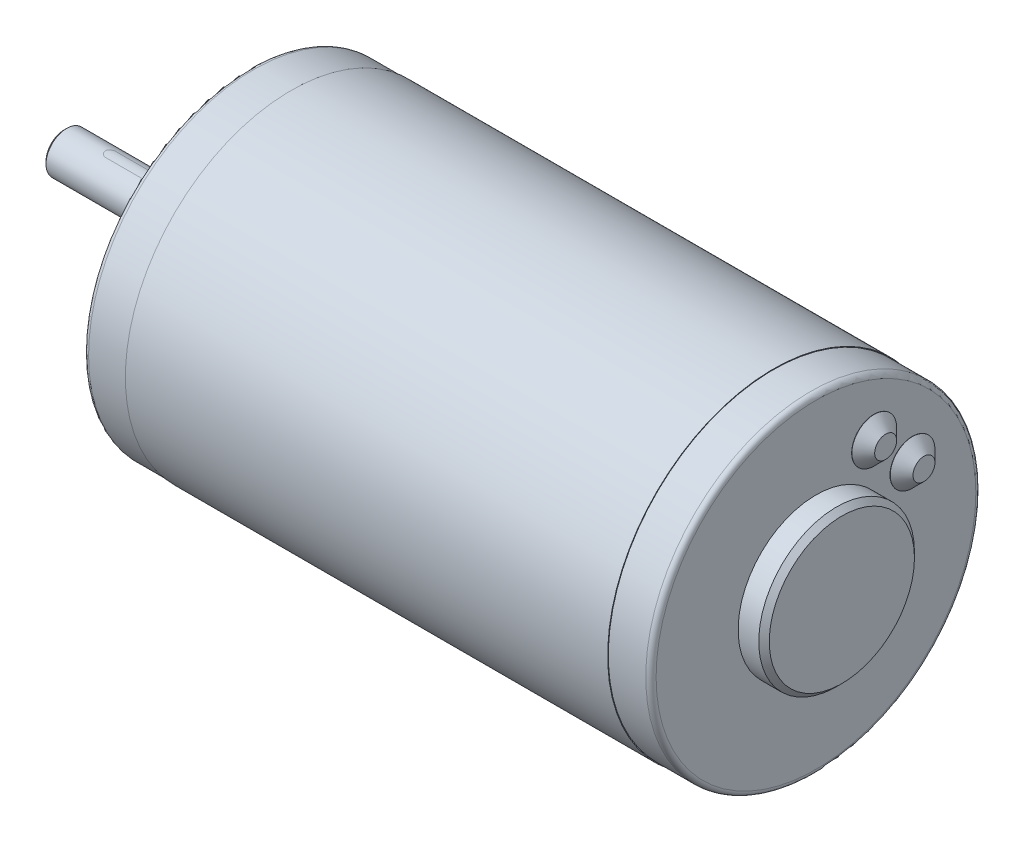
ISO-10303-21;
HEADER;
FILE_DESCRIPTION(('STEP AP214'),'2;1');
FILE_NAME('part.step','',(''),(''),'','','');
FILE_SCHEMA(('AUTOMOTIVE_DESIGN { 1 0 10303 214 1 1 1 1 }'));
ENDSEC;
DATA;
#1=APPLICATION_CONTEXT('core data for automotive mechanical design processes');
#2=APPLICATION_PROTOCOL_DEFINITION('international standard','automotive_design',2000,#1);
#3=PRODUCT_CONTEXT('',#1,'mechanical');
#4=PRODUCT('Part','Part','',(#3));
#5=PRODUCT_RELATED_PRODUCT_CATEGORY('part','',(#4));
#6=PRODUCT_DEFINITION_FORMATION('','',#4);
#7=PRODUCT_DEFINITION_CONTEXT('part definition',#1,'design');
#8=PRODUCT_DEFINITION('design','',#6,#7);
#9=PRODUCT_DEFINITION_SHAPE('','',#8);
#10=(LENGTH_UNIT() NAMED_UNIT(*) SI_UNIT(.MILLI.,.METRE.));
#11=(NAMED_UNIT(*) PLANE_ANGLE_UNIT() SI_UNIT($,.RADIAN.));
#12=(NAMED_UNIT(*) SI_UNIT($,.STERADIAN.) SOLID_ANGLE_UNIT());
#13=UNCERTAINTY_MEASURE_WITH_UNIT(LENGTH_MEASURE(1.E-05),#10,'distance_accuracy_value','');
#14=(GEOMETRIC_REPRESENTATION_CONTEXT(3) GLOBAL_UNCERTAINTY_ASSIGNED_CONTEXT((#13)) GLOBAL_UNIT_ASSIGNED_CONTEXT((#10,
#11,#12)) REPRESENTATION_CONTEXT('',''));
#15=CARTESIAN_POINT('',(0.,0.,0.));
#16=DIRECTION('',(0.,0.,1.));
#17=DIRECTION('',(1.,0.,0.));
#18=AXIS2_PLACEMENT_3D('',#15,#16,#17);
#19=CARTESIAN_POINT('',(-4.,0.,0.));
#20=DIRECTION('',(-1.,0.,0.));
#21=DIRECTION('',(0.,0.,1.));
#22=AXIS2_PLACEMENT_3D('',#19,#20,#21);
#23=PLANE('',#22);
#24=CARTESIAN_POINT('',(-4.,0.,0.));
#25=DIRECTION('',(-1.,0.,0.));
#26=DIRECTION('',(0.,0.,1.));
#27=AXIS2_PLACEMENT_3D('',#24,#25,#26);
#28=CIRCLE('',#27,8.50900000000004);
#29=CARTESIAN_POINT('',(-4.,0.,8.50900000000004));
#30=VERTEX_POINT('',#29);
#31=EDGE_CURVE('P0_E194',#30,#30,#28,.T.);
#32=ORIENTED_EDGE('',*,*,#31,.T.);
#33=EDGE_LOOP('',(#32));
#34=FACE_BOUND('',#33,.T.);
#35=CARTESIAN_POINT('',(-4.,0.,0.));
#36=DIRECTION('',(-1.,0.,0.));
#37=DIRECTION('',(0.,0.,1.));
#38=AXIS2_PLACEMENT_3D('',#35,#36,#37);
#39=CIRCLE('',#38,4.);
#40=CARTESIAN_POINT('',(-4.,0.,4.));
#41=VERTEX_POINT('',#40);
#42=EDGE_CURVE('P0_E120',#41,#41,#39,.T.);
#43=ORIENTED_EDGE('',*,*,#42,.F.);
#44=EDGE_LOOP('',(#43));
#45=FACE_BOUND('',#44,.T.);
#46=ADVANCED_FACE('P0_F37',(#34,#45),#23,.T.);
#47=CARTESIAN_POINT('',(0.,0.,0.));
#48=DIRECTION('',(-1.,0.,0.));
#49=DIRECTION('',(0.,0.,1.));
#50=AXIS2_PLACEMENT_3D('',#47,#48,#49);
#51=PLANE('',#50);
#52=CARTESIAN_POINT('',(0.,0.,0.));
#53=DIRECTION('',(-1.,0.,0.));
#54=DIRECTION('',(0.,0.,1.));
#55=AXIS2_PLACEMENT_3D('',#52,#53,#54);
#56=CIRCLE('',#55,30.877);
#57=CARTESIAN_POINT('',(0.,0.,30.877));
#58=VERTEX_POINT('',#57);
#59=EDGE_CURVE('P0_E45',#58,#58,#56,.T.);
#60=ORIENTED_EDGE('',*,*,#59,.T.);
#61=EDGE_LOOP('',(#60));
#62=FACE_BOUND('',#61,.T.);
#63=CARTESIAN_POINT('',(0.,25.4,0.));
#64=DIRECTION('',(-1.,0.,0.));
#65=DIRECTION('',(0.,0.,1.));
#66=AXIS2_PLACEMENT_3D('',#63,#64,#65);
#67=CIRCLE('',#66,2.01929999999999);
#68=CARTESIAN_POINT('',(0.,25.4,2.01929999999999));
#69=VERTEX_POINT('',#68);
#70=EDGE_CURVE('P0_E94',#69,#69,#67,.T.);
#71=ORIENTED_EDGE('',*,*,#70,.F.);
#72=EDGE_LOOP('',(#71));
#73=FACE_BOUND('',#72,.T.);
#74=CARTESIAN_POINT('',(0.,-25.4,0.));
#75=DIRECTION('',(-1.,0.,0.));
#76=DIRECTION('',(0.,0.,1.));
#77=AXIS2_PLACEMENT_3D('',#74,#75,#76);
#78=CIRCLE('',#77,2.01929999999999);
#79=CARTESIAN_POINT('',(0.,-25.4,2.01929999999999));
#80=VERTEX_POINT('',#79);
#81=EDGE_CURVE('P0_E93',#80,#80,#78,.T.);
#82=ORIENTED_EDGE('',*,*,#81,.F.);
#83=EDGE_LOOP('',(#82));
#84=FACE_BOUND('',#83,.T.);
#85=CARTESIAN_POINT('',(0.,0.,0.));
#86=DIRECTION('',(-1.,0.,0.));
#87=DIRECTION('',(0.,0.,1.));
#88=AXIS2_PLACEMENT_3D('',#85,#86,#87);
#89=CIRCLE('',#88,9.525);
#90=CARTESIAN_POINT('',(0.,0.,9.525));
#91=VERTEX_POINT('',#90);
#92=EDGE_CURVE('P0_E164',#91,#91,#89,.T.);
#93=ORIENTED_EDGE('',*,*,#92,.F.);
#94=EDGE_LOOP('',(#93));
#95=FACE_BOUND('',#94,.T.);
#96=ADVANCED_FACE('P0_F214',(#62,#73,#84,#95),#51,.T.);
#97=CARTESIAN_POINT('',(8.2296,32.004,0.));
#98=DIRECTION('',(-1.,0.,0.));
#99=DIRECTION('',(0.,0.,1.));
#100=AXIS2_PLACEMENT_3D('',#97,#98,#99);
#101=PLANE('',#100);
#102=CARTESIAN_POINT('',(8.2296,0.,0.));
#103=DIRECTION('',(1.,0.,0.));
#104=DIRECTION('',(0.,0.,-1.));
#105=AXIS2_PLACEMENT_3D('',#102,#103,#104);
#106=CIRCLE('',#105,32.004);
#107=CARTESIAN_POINT('',(8.2296,0.,-32.004));
#108=VERTEX_POINT('',#107);
#109=EDGE_CURVE('P0_E185',#108,#108,#106,.T.);
#110=ORIENTED_EDGE('',*,*,#109,.F.);
#111=EDGE_LOOP('',(#110));
#112=FACE_BOUND('',#111,.T.);
#113=CARTESIAN_POINT('',(8.2296,0.,0.));
#114=DIRECTION('',(-1.,0.,0.));
#115=DIRECTION('',(0.,0.,1.));
#116=AXIS2_PLACEMENT_3D('',#113,#114,#115);
#117=CIRCLE('',#116,31.877);
#118=CARTESIAN_POINT('',(8.2296,0.,31.877));
#119=VERTEX_POINT('',#118);
#120=EDGE_CURVE('P0_E167',#119,#119,#117,.T.);
#121=ORIENTED_EDGE('',*,*,#120,.F.);
#122=EDGE_LOOP('',(#121));
#123=FACE_BOUND('',#122,.T.);
#124=ADVANCED_FACE('P0_F232',(#112,#123),#101,.T.);
#125=CARTESIAN_POINT('',(109.6,0.,0.));
#126=DIRECTION('',(1.,0.,0.));
#127=DIRECTION('',(0.,0.,-1.));
#128=AXIS2_PLACEMENT_3D('',#125,#126,#127);
#129=PLANE('',#128);
#130=CARTESIAN_POINT('',(109.6,0.,0.));
#131=DIRECTION('',(1.,0.,0.));
#132=DIRECTION('',(0.,0.,-1.));
#133=AXIS2_PLACEMENT_3D('',#130,#131,#132);
#134=CIRCLE('',#133,30.877);
#135=CARTESIAN_POINT('',(109.6,0.,-30.877));
#136=VERTEX_POINT('',#135);
#137=EDGE_CURVE('P0_E206',#136,#136,#134,.T.);
#138=ORIENTED_EDGE('',*,*,#137,.T.);
#139=EDGE_LOOP('',(#138));
#140=FACE_BOUND('',#139,.T.);
#141=CARTESIAN_POINT('',(109.6,18.6070906828553,-11.2073596390943));
#142=DIRECTION('',(1.,0.,0.));
#143=DIRECTION('',(0.,0.,-1.));
#144=AXIS2_PLACEMENT_3D('',#141,#142,#143);
#145=CIRCLE('',#144,4.318);
#146=CARTESIAN_POINT('',(109.6,18.6070906828553,-15.5253596390943));
#147=VERTEX_POINT('',#146);
#148=EDGE_CURVE('P0_E191',#147,#147,#145,.T.);
#149=ORIENTED_EDGE('',*,*,#148,.F.);
#150=EDGE_LOOP('',(#149));
#151=FACE_BOUND('',#150,.T.);
#152=CARTESIAN_POINT('',(109.6,11.2073596390943,-18.6070906828553));
#153=DIRECTION('',(1.,0.,0.));
#154=DIRECTION('',(0.,0.,-1.));
#155=AXIS2_PLACEMENT_3D('',#152,#153,#154);
#156=CIRCLE('',#155,4.318);
#157=CARTESIAN_POINT('',(109.6,11.2073596390943,-22.9250906828553));
#158=VERTEX_POINT('',#157);
#159=EDGE_CURVE('P0_E188',#158,#158,#156,.T.);
#160=ORIENTED_EDGE('',*,*,#159,.F.);
#161=EDGE_LOOP('',(#160));
#162=FACE_BOUND('',#161,.T.);
#163=CARTESIAN_POINT('',(109.6,0.,0.));
#164=DIRECTION('',(1.,0.,0.));
#165=DIRECTION('',(0.,0.,-1.));
#166=AXIS2_PLACEMENT_3D('',#163,#164,#165);
#167=CIRCLE('',#166,15.0368);
#168=CARTESIAN_POINT('',(109.6,0.,-15.0368));
#169=VERTEX_POINT('',#168);
#170=EDGE_CURVE('P0_E173',#169,#169,#167,.T.);
#171=ORIENTED_EDGE('',*,*,#170,.F.);
#172=EDGE_LOOP('',(#171));
#173=FACE_BOUND('',#172,.T.);
#174=ADVANCED_FACE('P0_F260',(#140,#151,#162,#173),#129,.T.);
#175=CARTESIAN_POINT('',(101.3704,0.,0.));
#176=DIRECTION('',(1.,0.,0.));
#177=DIRECTION('',(0.,0.,-1.));
#178=AXIS2_PLACEMENT_3D('',#175,#176,#177);
#179=PLANE('',#178);
#180=CARTESIAN_POINT('',(101.3704,0.,0.));
#181=DIRECTION('',(1.,0.,0.));
#182=DIRECTION('',(0.,0.,-1.));
#183=AXIS2_PLACEMENT_3D('',#180,#181,#182);
#184=CIRCLE('',#183,32.004);
#185=CARTESIAN_POINT('',(101.3704,0.,-32.004));
#186=VERTEX_POINT('',#185);
#187=EDGE_CURVE('P0_E182',#186,#186,#184,.T.);
#188=ORIENTED_EDGE('',*,*,#187,.T.);
#189=EDGE_LOOP('',(#188));
#190=FACE_BOUND('',#189,.T.);
#191=CARTESIAN_POINT('',(101.3704,0.,0.));
#192=DIRECTION('',(1.,0.,0.));
#193=DIRECTION('',(0.,0.,-1.));
#194=AXIS2_PLACEMENT_3D('',#191,#192,#193);
#195=CIRCLE('',#194,31.877);
#196=CARTESIAN_POINT('',(101.3704,0.,-31.877));
#197=VERTEX_POINT('',#196);
#198=EDGE_CURVE('P0_E177',#197,#197,#195,.T.);
#199=ORIENTED_EDGE('',*,*,#198,.F.);
#200=EDGE_LOOP('',(#199));
#201=FACE_BOUND('',#200,.T.);
#202=ADVANCED_FACE('P0_F263',(#190,#201),#179,.T.);
#203=CARTESIAN_POINT('',(8.2296,0.,0.));
#204=DIRECTION('',(1.,0.,0.));
#205=DIRECTION('',(0.,0.,-1.));
#206=AXIS2_PLACEMENT_3D('',#203,#204,#205);
#207=CYLINDRICAL_SURFACE('',#206,32.004);
#208=ORIENTED_EDGE('',*,*,#109,.T.);
#209=EDGE_LOOP('',(#208));
#210=FACE_BOUND('',#209,.T.);
#211=ORIENTED_EDGE('',*,*,#187,.F.);
#212=EDGE_LOOP('',(#211));
#213=FACE_BOUND('',#212,.T.);
#214=ADVANCED_FACE('P0_F267',(#210,#213),#207,.T.);
#215=CARTESIAN_POINT('',(109.6,0.,0.));
#216=DIRECTION('',(-1.,0.,0.));
#217=DIRECTION('',(0.,0.,1.));
#218=AXIS2_PLACEMENT_3D('',#215,#216,#217);
#219=CYLINDRICAL_SURFACE('',#218,31.877);
#220=CARTESIAN_POINT('',(108.6,0.,0.));
#221=DIRECTION('',(1.,0.,0.));
#222=DIRECTION('',(0.,0.,-1.));
#223=AXIS2_PLACEMENT_3D('',#220,#221,#222);
#224=CIRCLE('',#223,31.877);
#225=CARTESIAN_POINT('',(108.6,0.,-31.877));
#226=VERTEX_POINT('',#225);
#227=EDGE_CURVE('P0_E209',#226,#226,#224,.F.);
#228=ORIENTED_EDGE('',*,*,#227,.T.);
#229=EDGE_LOOP('',(#228));
#230=FACE_BOUND('',#229,.T.);
#231=ORIENTED_EDGE('',*,*,#198,.T.);
#232=EDGE_LOOP('',(#231));
#233=FACE_BOUND('',#232,.T.);
#234=ADVANCED_FACE('P0_F258',(#230,#233),#219,.T.);
#235=CARTESIAN_POINT('',(113.584,0.,0.));
#236=DIRECTION('',(-1.,0.,0.));
#237=DIRECTION('',(0.,0.,1.));
#238=AXIS2_PLACEMENT_3D('',#235,#236,#237);
#239=CYLINDRICAL_SURFACE('',#238,15.0368);
#240=CARTESIAN_POINT('',(113.584,0.,0.));
#241=DIRECTION('',(1.,0.,0.));
#242=DIRECTION('',(0.,0.,-1.));
#243=AXIS2_PLACEMENT_3D('',#240,#241,#242);
#244=CIRCLE('',#243,15.0368);
#245=CARTESIAN_POINT('',(113.584,0.,-15.0368));
#246=VERTEX_POINT('',#245);
#247=EDGE_CURVE('P0_E174',#246,#246,#244,.T.);
#248=ORIENTED_EDGE('',*,*,#247,.F.);
#249=EDGE_LOOP('',(#248));
#250=FACE_BOUND('',#249,.T.);
#251=ORIENTED_EDGE('',*,*,#170,.T.);
#252=EDGE_LOOP('',(#251));
#253=FACE_BOUND('',#252,.T.);
#254=ADVANCED_FACE('P0_F254',(#250,#253),#239,.T.);
#255=CARTESIAN_POINT('',(113.584,0.,0.));
#256=DIRECTION('',(-1.,0.,0.));
#257=DIRECTION('',(0.,0.,-1.));
#258=AXIS2_PLACEMENT_3D('',#255,#256,#257);
#259=CONICAL_SURFACE('',#258,15.0368,0.785398163397437);
#260=CARTESIAN_POINT('',(114.6,0.,0.));
#261=DIRECTION('',(1.,0.,0.));
#262=DIRECTION('',(0.,0.,-1.));
#263=AXIS2_PLACEMENT_3D('',#260,#261,#262);
#264=CIRCLE('',#263,14.0208);
#265=CARTESIAN_POINT('',(114.6,0.,-14.0208));
#266=VERTEX_POINT('',#265);
#267=EDGE_CURVE('P0_E170',#266,#266,#264,.T.);
#268=ORIENTED_EDGE('',*,*,#267,.F.);
#269=EDGE_LOOP('',(#268));
#270=FACE_BOUND('',#269,.T.);
#271=ORIENTED_EDGE('',*,*,#247,.T.);
#272=EDGE_LOOP('',(#271));
#273=FACE_BOUND('',#272,.T.);
#274=ADVANCED_FACE('P0_F250',(#270,#273),#259,.T.);
#275=CARTESIAN_POINT('',(114.6,0.,0.));
#276=DIRECTION('',(1.,0.,0.));
#277=DIRECTION('',(0.,0.,-1.));
#278=AXIS2_PLACEMENT_3D('',#275,#276,#277);
#279=PLANE('',#278);
#280=ORIENTED_EDGE('',*,*,#267,.T.);
#281=EDGE_LOOP('',(#280));
#282=FACE_BOUND('',#281,.T.);
#283=ADVANCED_FACE('P0_F246',(#282),#279,.T.);
#284=CARTESIAN_POINT('',(0.,0.,0.));
#285=DIRECTION('',(1.,0.,0.));
#286=DIRECTION('',(0.,0.,-1.));
#287=AXIS2_PLACEMENT_3D('',#284,#285,#286);
#288=CYLINDRICAL_SURFACE('',#287,31.877);
#289=CARTESIAN_POINT('',(0.999999999999998,0.,0.));
#290=DIRECTION('',(-1.,0.,0.));
#291=DIRECTION('',(0.,0.,1.));
#292=AXIS2_PLACEMENT_3D('',#289,#290,#291);
#293=CIRCLE('',#292,31.877);
#294=CARTESIAN_POINT('',(0.999999999999998,0.,31.877));
#295=VERTEX_POINT('',#294);
#296=EDGE_CURVE('P0_E11',#295,#295,#293,.F.);
#297=ORIENTED_EDGE('',*,*,#296,.T.);
#298=EDGE_LOOP('',(#297));
#299=FACE_BOUND('',#298,.T.);
#300=ORIENTED_EDGE('',*,*,#120,.T.);
#301=EDGE_LOOP('',(#300));
#302=FACE_BOUND('',#301,.T.);
#303=ADVANCED_FACE('P0_F241',(#299,#302),#288,.T.);
#304=CARTESIAN_POINT('',(-4.,0.,0.));
#305=DIRECTION('',(1.,0.,0.));
#306=DIRECTION('',(0.,0.,-1.));
#307=AXIS2_PLACEMENT_3D('',#304,#305,#306);
#308=CYLINDRICAL_SURFACE('',#307,9.525);
#309=CARTESIAN_POINT('',(-2.98400000000005,0.,0.));
#310=DIRECTION('',(-1.,0.,0.));
#311=DIRECTION('',(0.,0.,1.));
#312=AXIS2_PLACEMENT_3D('',#309,#310,#311);
#313=CIRCLE('',#312,9.525);
#314=CARTESIAN_POINT('',(-2.98400000000005,0.,9.525));
#315=VERTEX_POINT('',#314);
#316=EDGE_CURVE('P0_E197',#315,#315,#313,.F.);
#317=ORIENTED_EDGE('',*,*,#316,.T.);
#318=EDGE_LOOP('',(#317));
#319=FACE_BOUND('',#318,.T.);
#320=ORIENTED_EDGE('',*,*,#92,.T.);
#321=EDGE_LOOP('',(#320));
#322=FACE_BOUND('',#321,.T.);
#323=ADVANCED_FACE('P0_F239',(#319,#322),#308,.T.);
#324=CARTESIAN_POINT('',(-35.6,0.,0.));
#325=DIRECTION('',(1.,0.,0.));
#326=DIRECTION('',(0.,0.,-1.));
#327=AXIS2_PLACEMENT_3D('',#324,#325,#326);
#328=CYLINDRICAL_SURFACE('',#327,4.);
#329=CARTESIAN_POINT('',(-35.099999999993,0.,0.));
#330=DIRECTION('',(-1.,0.,0.));
#331=DIRECTION('',(0.,0.,1.));
#332=AXIS2_PLACEMENT_3D('',#329,#330,#331);
#333=CIRCLE('',#332,4.);
#334=CARTESIAN_POINT('',(-35.099999999993,0.,4.));
#335=VERTEX_POINT('',#334);
#336=EDGE_CURVE('P0_E203',#335,#335,#333,.F.);
#337=ORIENTED_EDGE('',*,*,#336,.T.);
#338=EDGE_LOOP('',(#337));
#339=FACE_BOUND('',#338,.T.);
#340=DIRECTION('',(1.,0.,0.));
#341=VECTOR('',#340,1.);
#342=CARTESIAN_POINT('',(0.,3.87298334620741,-1.));
#343=LINE('',#342,#341);
#344=CARTESIAN_POINT('',(-26.6,3.87298334620741,-1.));
#345=VERTEX_POINT('',#344);
#346=CARTESIAN_POINT('',(-7.1,3.87298334620741,-1.));
#347=VERTEX_POINT('',#346);
#348=EDGE_CURVE('P0_E139',#345,#347,#343,.T.);
#349=ORIENTED_EDGE('',*,*,#348,.T.);
#350=CARTESIAN_POINT('',(-7.1,3.87298334620741,-1.));
#351=CARTESIAN_POINT('',(-7.07233701489346,3.87298148580177,-1.00000033749611));
#352=CARTESIAN_POINT('',(-7.04468773698177,3.8732800994947,-0.998851407375366));
#353=CARTESIAN_POINT('',(-6.98959596469644,3.87445904774558,-0.994271295395754));
#354=CARTESIAN_POINT('',(-6.96215343631291,3.87533928441687,-0.990840497572679));
#355=CARTESIAN_POINT('',(-6.88054682679116,3.87881710972053,-0.977175239382526));
#356=CARTESIAN_POINT('',(-6.82694353151779,3.88225203148808,-0.963567695172493));
#357=CARTESIAN_POINT('',(-6.72287532621804,3.89095422588002,-0.927798076247997));
#358=CARTESIAN_POINT('',(-6.67241012178714,3.89622132630929,-0.905636805423836));
#359=CARTESIAN_POINT('',(-6.57588855135267,3.90799134471939,-0.853415378025865));
#360=CARTESIAN_POINT('',(-6.52983337210904,3.91449459395647,-0.823353103356933));
#361=CARTESIAN_POINT('',(-6.4424561180939,3.92816262398025,-0.755484471828069));
#362=CARTESIAN_POINT('',(-6.40124511375448,3.93533791028915,-0.717537268783976));
#363=CARTESIAN_POINT('',(-6.32569791051729,3.94945104396193,-0.63527578051623));
#364=CARTESIAN_POINT('',(-6.29136281053206,3.95638885322537,-0.590960479478831));
#365=CARTESIAN_POINT('',(-6.23008899838136,3.96936182283248,-0.496456899401691));
#366=CARTESIAN_POINT('',(-6.20326010401603,3.9753830468173,-0.446195340334474));
#367=CARTESIAN_POINT('',(-6.1584752658033,3.98572346250588,-0.341702590842919));
#368=CARTESIAN_POINT('',(-6.14051757570017,3.990042989147,-0.28747218408301));
#369=CARTESIAN_POINT('',(-6.11434100722257,3.99641900005128,-0.17774410852516));
#370=CARTESIAN_POINT('',(-6.10593232757718,3.998519529013,-0.122294322002858));
#371=CARTESIAN_POINT('',(-6.09849662845671,4.00037438150815,-0.0107327756816796));
#372=CARTESIAN_POINT('',(-6.09946842980766,4.00012899993444,0.0453789000287057));
#373=CARTESIAN_POINT('',(-6.11062996368545,3.99735237365735,0.155352492972096));
#374=CARTESIAN_POINT('',(-6.12061461659948,3.9948719867736,0.209236701739855));
#375=CARTESIAN_POINT('',(-6.14918867918275,3.98796330636495,0.31453871108434));
#376=CARTESIAN_POINT('',(-6.16777846956858,3.98353492665556,0.365956402423988));
#377=CARTESIAN_POINT('',(-6.21320128067065,3.97314997761798,0.465407286024539));
#378=CARTESIAN_POINT('',(-6.24010739423284,3.96717993827555,0.513405629602248));
#379=CARTESIAN_POINT('',(-6.30134312983347,3.95435945541919,0.604276631230014));
#380=CARTESIAN_POINT('',(-6.33567387025322,3.94750887933198,0.647148515562289));
#381=CARTESIAN_POINT('',(-6.41187891208131,3.93345566022865,0.72776938970849));
#382=CARTESIAN_POINT('',(-6.45393163653981,3.92624850477685,0.765349103054127));
#383=CARTESIAN_POINT('',(-6.54382986692773,3.91246168284006,0.832969575186237));
#384=CARTESIAN_POINT('',(-6.59167695328356,3.90588218842993,0.863008270245062));
#385=CARTESIAN_POINT('',(-6.69214559782377,3.89407813586325,0.914804709285962));
#386=CARTESIAN_POINT('',(-6.74479146489609,3.88886106009136,0.936517017887269));
#387=CARTESIAN_POINT('',(-6.85311692841829,3.88047058807055,0.970702351849829));
#388=CARTESIAN_POINT('',(-6.90879185514984,3.87729413761435,0.983189189212132));
#389=CARTESIAN_POINT('',(-6.9874573807589,3.87455290681524,0.993904635150938));
#390=CARTESIAN_POINT('',(-7.00991970321318,3.87396523110859,0.996190790966708));
#391=CARTESIAN_POINT('',(-7.05491778990932,3.87318062488974,0.999236757697394));
#392=CARTESIAN_POINT('',(-7.07745337595529,3.87298306219461,0.999999038096045));
#393=CARTESIAN_POINT('',(-7.1,3.87298334620741,1.));
#394=B_SPLINE_CURVE_WITH_KNOTS('',3,(#350,#351,#352,#353,#354,#355,#356,#357,#358,#359,#360,
#361,#362,#363,#364,#365,#366,#367,#368,#369,#370,#371,#372,#373,#374,#375,#376,#377,#378,#379,
#380,#381,#382,#383,#384,#385,#386,#387,#388,#389,#390,#391,#392,#393),.UNSPECIFIED.,.F.,.F.,(4,
2,2,2,2,2,2,2,2,2,2,2,2,2,2,2,2,2,2,2,2,4),(0.,0.0829365303397693,0.165859106084651,
0.331229963080317,0.496585282091498,0.661984974726749,0.830641897427974,0.999325753539193,
1.17036187098235,1.34136430732424,1.50890481515325,1.67642426256639,1.84022545479276,
2.00403389475838,2.16932509450376,2.33464120964329,2.50441429534542,2.67423379180967,
2.84496720161068,3.01544447539986,3.08315848722648,3.15076267731671),.UNSPECIFIED.);
#395=CARTESIAN_POINT('',(-7.1,3.87298334620741,1.));
#396=VERTEX_POINT('',#395);
#397=EDGE_CURVE('P0_E116',#347,#396,#394,.T.);
#398=ORIENTED_EDGE('',*,*,#397,.T.);
#399=DIRECTION('',(1.,0.,0.));
#400=VECTOR('',#399,1.);
#401=CARTESIAN_POINT('',(0.,3.87298334620741,1.));
#402=LINE('',#401,#400);
#403=CARTESIAN_POINT('',(-26.6,3.87298334620741,1.));
#404=VERTEX_POINT('',#403);
#405=EDGE_CURVE('P0_E154',#396,#404,#402,.F.);
#406=ORIENTED_EDGE('',*,*,#405,.T.);
#407=CARTESIAN_POINT('',(-26.6,3.87298334620741,1.));
#408=CARTESIAN_POINT('',(-26.6276629851065,3.87298148580177,1.00000033749611));
#409=CARTESIAN_POINT('',(-26.6553122630182,3.8732800994947,0.998851407375366));
#410=CARTESIAN_POINT('',(-26.7104040353036,3.87445904774558,0.994271295395754));
#411=CARTESIAN_POINT('',(-26.7378465636871,3.87533928441687,0.990840497572679));
#412=CARTESIAN_POINT('',(-26.8194531732088,3.87881710972053,0.977175239382526));
#413=CARTESIAN_POINT('',(-26.8730564684822,3.88225203148808,0.963567695172493));
#414=CARTESIAN_POINT('',(-26.977124673782,3.89095422588002,0.927798076247996));
#415=CARTESIAN_POINT('',(-27.0275898782129,3.89622132630929,0.905636805423835));
#416=CARTESIAN_POINT('',(-27.1241114486473,3.90799134471939,0.853415378025864));
#417=CARTESIAN_POINT('',(-27.170166627891,3.91449459395647,0.823353103356932));
#418=CARTESIAN_POINT('',(-27.2575438819061,3.92816262398025,0.755484471828069));
#419=CARTESIAN_POINT('',(-27.2987548862455,3.93533791028915,0.717537268783975));
#420=CARTESIAN_POINT('',(-27.3743020894827,3.94945104396193,0.635275780516229));
#421=CARTESIAN_POINT('',(-27.4086371894679,3.95638885322537,0.59096047947883));
#422=CARTESIAN_POINT('',(-27.4699110016186,3.96936182283248,0.496456899401689));
#423=CARTESIAN_POINT('',(-27.496739895984,3.9753830468173,0.446195340334472));
#424=CARTESIAN_POINT('',(-27.5415247341967,3.98572346250588,0.341702590842916));
#425=CARTESIAN_POINT('',(-27.5594824242998,3.990042989147,0.287472184083007));
#426=CARTESIAN_POINT('',(-27.5856589927774,3.99641900005128,0.177744108525158));
#427=CARTESIAN_POINT('',(-27.5940676724228,3.998519529013,0.122294322002856));
#428=CARTESIAN_POINT('',(-27.6015033715433,4.00037438150815,0.0107327756816781));
#429=CARTESIAN_POINT('',(-27.6005315701923,4.00012899993444,-0.0453789000287067));
#430=CARTESIAN_POINT('',(-27.5893700363146,3.99735237365735,-0.155352492972096));
#431=CARTESIAN_POINT('',(-27.5793853834005,3.9948719867736,-0.209236701739855));
#432=CARTESIAN_POINT('',(-27.5508113208173,3.98796330636495,-0.31453871108434));
#433=CARTESIAN_POINT('',(-27.5322215304314,3.98353492665556,-0.365956402423988));
#434=CARTESIAN_POINT('',(-27.4867987193294,3.97314997761798,-0.46540728602454));
#435=CARTESIAN_POINT('',(-27.4598926057672,3.96717993827555,-0.513405629602248));
#436=CARTESIAN_POINT('',(-27.3986568701665,3.95435945541919,-0.604276631230015));
#437=CARTESIAN_POINT('',(-27.3643261297468,3.94750887933198,-0.64714851556229));
#438=CARTESIAN_POINT('',(-27.2881210879187,3.93345566022865,-0.727769389708492));
#439=CARTESIAN_POINT('',(-27.2460683634602,3.92624850477685,-0.765349103054128));
#440=CARTESIAN_POINT('',(-27.1561701330723,3.91246168284006,-0.832969575186237));
#441=CARTESIAN_POINT('',(-27.1083230467164,3.90588218842993,-0.863008270245062));
#442=CARTESIAN_POINT('',(-27.0078544021762,3.89407813586325,-0.914804709285961));
#443=CARTESIAN_POINT('',(-26.9552085351039,3.88886106009136,-0.936517017887269));
#444=CARTESIAN_POINT('',(-26.8468830715817,3.88047058807054,-0.970702351849828));
#445=CARTESIAN_POINT('',(-26.7912081448502,3.87729413761435,-0.983189189212131));
#446=CARTESIAN_POINT('',(-26.7125426192411,3.87455290681524,-0.993904635150938));
#447=CARTESIAN_POINT('',(-26.6900802967868,3.87396523110859,-0.996190790966708));
#448=CARTESIAN_POINT('',(-26.6450822100907,3.87318062488974,-0.999236757697394));
#449=CARTESIAN_POINT('',(-26.6225466240447,3.87298306219461,-0.999999038096045));
#450=CARTESIAN_POINT('',(-26.6,3.87298334620741,-1.));
#451=B_SPLINE_CURVE_WITH_KNOTS('',3,(#407,#408,#409,#410,#411,#412,#413,#414,#415,#416,#417,
#418,#419,#420,#421,#422,#423,#424,#425,#426,#427,#428,#429,#430,#431,#432,#433,#434,#435,#436,
#437,#438,#439,#440,#441,#442,#443,#444,#445,#446,#447,#448,#449,#450),.UNSPECIFIED.,.F.,.F.,(4,
2,2,2,2,2,2,2,2,2,2,2,2,2,2,2,2,2,2,2,2,4),(0.,0.0829365303397727,0.165859106084653,
0.331229963080318,0.496585282091499,0.661984974726751,0.830641897427976,0.999325753539196,
1.17036187098235,1.34136430732425,1.50890481515325,1.67642426256639,1.84022545479276,
2.00403389475838,2.16932509450376,2.33464120964329,2.50441429534542,2.67423379180967,
2.84496720161068,3.01544447539986,3.08315848722649,3.15076267731671),.UNSPECIFIED.);
#452=EDGE_CURVE('P0_E52',#404,#345,#451,.T.);
#453=ORIENTED_EDGE('',*,*,#452,.T.);
#454=EDGE_LOOP('',(#349,#398,#406,#453));
#455=FACE_BOUND('',#454,.T.);
#456=ORIENTED_EDGE('',*,*,#42,.T.);
#457=EDGE_LOOP('',(#456));
#458=FACE_BOUND('',#457,.T.);
#459=ADVANCED_FACE('P0_F237',(#339,#455,#458),#328,.T.);
#460=CARTESIAN_POINT('',(-35.6,0.,0.));
#461=DIRECTION('',(-1.,0.,0.));
#462=DIRECTION('',(0.,0.,1.));
#463=AXIS2_PLACEMENT_3D('',#460,#461,#462);
#464=PLANE('',#463);
#465=CARTESIAN_POINT('',(-35.6,0.,0.));
#466=DIRECTION('',(-1.,0.,0.));
#467=DIRECTION('',(0.,0.,1.));
#468=AXIS2_PLACEMENT_3D('',#465,#466,#467);
#469=CIRCLE('',#468,3.49999999993619);
#470=CARTESIAN_POINT('',(-35.6,0.,3.49999999993619));
#471=VERTEX_POINT('',#470);
#472=EDGE_CURVE('P0_E200',#471,#471,#469,.T.);
#473=ORIENTED_EDGE('',*,*,#472,.T.);
#474=EDGE_LOOP('',(#473));
#475=FACE_BOUND('',#474,.T.);
#476=ADVANCED_FACE('P0_F290',(#475),#464,.T.);
#477=CARTESIAN_POINT('',(-7.1,32.005,0.));
#478=DIRECTION('',(0.,-1.,0.));
#479=DIRECTION('',(0.,0.,-1.));
#480=AXIS2_PLACEMENT_3D('',#477,#478,#479);
#481=CYLINDRICAL_SURFACE('',#480,1.);
#482=ORIENTED_EDGE('',*,*,#397,.F.);
#483=DIRECTION('',(0.,-1.,0.));
#484=VECTOR('',#483,1.);
#485=CARTESIAN_POINT('',(-7.1,32.005,-1.));
#486=LINE('',#485,#484);
#487=CARTESIAN_POINT('',(-7.1,2.79999999999999,-1.));
#488=VERTEX_POINT('',#487);
#489=EDGE_CURVE('P0_E138',#347,#488,#486,.T.);
#490=ORIENTED_EDGE('',*,*,#489,.T.);
#491=CARTESIAN_POINT('',(-7.1,2.79999999999999,0.));
#492=DIRECTION('',(0.,-1.,0.));
#493=DIRECTION('',(0.,0.,-1.));
#494=AXIS2_PLACEMENT_3D('',#491,#492,#493);
#495=CIRCLE('',#494,1.);
#496=CARTESIAN_POINT('',(-7.1,2.79999999999999,1.));
#497=VERTEX_POINT('',#496);
#498=EDGE_CURVE('P0_E127',#488,#497,#495,.T.);
#499=ORIENTED_EDGE('',*,*,#498,.T.);
#500=DIRECTION('',(0.,-1.,0.));
#501=VECTOR('',#500,1.);
#502=CARTESIAN_POINT('',(-7.1,32.005,1.));
#503=LINE('',#502,#501);
#504=EDGE_CURVE('P0_E60',#396,#497,#503,.T.);
#505=ORIENTED_EDGE('',*,*,#504,.F.);
#506=EDGE_LOOP('',(#482,#490,#499,#505));
#507=FACE_BOUND('',#506,.T.);
#508=ADVANCED_FACE('P0_F292',(#507),#481,.F.);
#509=CARTESIAN_POINT('',(-26.6,32.005,-1.));
#510=DIRECTION('',(0.,0.,-1.));
#511=DIRECTION('',(-1.,0.,0.));
#512=AXIS2_PLACEMENT_3D('',#509,#510,#511);
#513=PLANE('',#512);
#514=ORIENTED_EDGE('',*,*,#348,.F.);
#515=DIRECTION('',(0.,-1.,0.));
#516=VECTOR('',#515,1.);
#517=CARTESIAN_POINT('',(-26.6,32.005,-1.));
#518=LINE('',#517,#516);
#519=CARTESIAN_POINT('',(-26.6,2.79999999999999,-1.));
#520=VERTEX_POINT('',#519);
#521=EDGE_CURVE('P0_E137',#345,#520,#518,.T.);
#522=ORIENTED_EDGE('',*,*,#521,.T.);
#523=DIRECTION('',(1.,0.,0.));
#524=VECTOR('',#523,1.);
#525=CARTESIAN_POINT('',(-26.6,2.79999999999999,-1.));
#526=LINE('',#525,#524);
#527=EDGE_CURVE('P0_E117',#520,#488,#526,.T.);
#528=ORIENTED_EDGE('',*,*,#527,.T.);
#529=ORIENTED_EDGE('',*,*,#489,.F.);
#530=EDGE_LOOP('',(#514,#522,#528,#529));
#531=FACE_BOUND('',#530,.T.);
#532=ADVANCED_FACE('P0_F297',(#531),#513,.F.);
#533=CARTESIAN_POINT('',(-26.6,32.005,0.));
#534=DIRECTION('',(0.,-1.,0.));
#535=DIRECTION('',(0.,0.,-1.));
#536=AXIS2_PLACEMENT_3D('',#533,#534,#535);
#537=CYLINDRICAL_SURFACE('',#536,1.);
#538=ORIENTED_EDGE('',*,*,#452,.F.);
#539=DIRECTION('',(0.,-1.,0.));
#540=VECTOR('',#539,1.);
#541=CARTESIAN_POINT('',(-26.6,32.005,1.));
#542=LINE('',#541,#540);
#543=CARTESIAN_POINT('',(-26.6,2.79999999999999,1.));
#544=VERTEX_POINT('',#543);
#545=EDGE_CURVE('P0_E129',#404,#544,#542,.T.);
#546=ORIENTED_EDGE('',*,*,#545,.T.);
#547=CARTESIAN_POINT('',(-26.6,2.79999999999999,0.));
#548=DIRECTION('',(0.,-1.,0.));
#549=DIRECTION('',(0.,0.,-1.));
#550=AXIS2_PLACEMENT_3D('',#547,#548,#549);
#551=CIRCLE('',#550,1.);
#552=EDGE_CURVE('P0_E121',#544,#520,#551,.T.);
#553=ORIENTED_EDGE('',*,*,#552,.T.);
#554=ORIENTED_EDGE('',*,*,#521,.F.);
#555=EDGE_LOOP('',(#538,#546,#553,#554));
#556=FACE_BOUND('',#555,.T.);
#557=ADVANCED_FACE('P0_F303',(#556),#537,.F.);
#558=CARTESIAN_POINT('',(-7.1,32.005,1.));
#559=DIRECTION('',(0.,0.,1.));
#560=DIRECTION('',(1.,0.,0.));
#561=AXIS2_PLACEMENT_3D('',#558,#559,#560);
#562=PLANE('',#561);
#563=ORIENTED_EDGE('',*,*,#405,.F.);
#564=ORIENTED_EDGE('',*,*,#504,.T.);
#565=DIRECTION('',(-1.,0.,0.));
#566=VECTOR('',#565,1.);
#567=CARTESIAN_POINT('',(-7.1,2.79999999999999,1.));
#568=LINE('',#567,#566);
#569=EDGE_CURVE('P0_E124',#497,#544,#568,.T.);
#570=ORIENTED_EDGE('',*,*,#569,.T.);
#571=ORIENTED_EDGE('',*,*,#545,.F.);
#572=EDGE_LOOP('',(#563,#564,#570,#571));
#573=FACE_BOUND('',#572,.T.);
#574=ADVANCED_FACE('P0_F306',(#573),#562,.F.);
#575=CARTESIAN_POINT('',(-7.1,2.79999999999999,0.));
#576=DIRECTION('',(0.,-1.,0.));
#577=DIRECTION('',(0.,0.,-1.));
#578=AXIS2_PLACEMENT_3D('',#575,#576,#577);
#579=PLANE('',#578);
#580=ORIENTED_EDGE('',*,*,#498,.F.);
#581=ORIENTED_EDGE('',*,*,#527,.F.);
#582=ORIENTED_EDGE('',*,*,#552,.F.);
#583=ORIENTED_EDGE('',*,*,#569,.F.);
#584=EDGE_LOOP('',(#580,#581,#582,#583));
#585=FACE_BOUND('',#584,.T.);
#586=ADVANCED_FACE('P0_F308',(#585),#579,.F.);
#587=CARTESIAN_POINT('',(109.6,11.2073596390943,-18.6070906828553));
#588=DIRECTION('',(1.,0.,0.));
#589=DIRECTION('',(0.,0.,-1.));
#590=AXIS2_PLACEMENT_3D('',#587,#588,#589);
#591=CYLINDRICAL_SURFACE('',#590,4.318);
#592=ORIENTED_EDGE('',*,*,#159,.T.);
#593=EDGE_LOOP('',(#592));
#594=FACE_BOUND('',#593,.T.);
#595=CARTESIAN_POINT('',(109.6479,11.2073596390943,-18.6070906828553));
#596=DIRECTION('',(1.,0.,0.));
#597=DIRECTION('',(0.,0.,-1.));
#598=AXIS2_PLACEMENT_3D('',#595,#596,#597);
#599=CIRCLE('',#598,4.318);
#600=CARTESIAN_POINT('',(109.6479,11.2073596390943,-22.9250906828553));
#601=VERTEX_POINT('',#600);
#602=EDGE_CURVE('P0_E110',#601,#601,#599,.T.);
#603=ORIENTED_EDGE('',*,*,#602,.F.);
#604=EDGE_LOOP('',(#603));
#605=FACE_BOUND('',#604,.T.);
#606=ADVANCED_FACE('P0_F313',(#594,#605),#591,.T.);
#607=CARTESIAN_POINT('',(111.847899999964,11.2073596390943,-18.6070906828553));
#608=DIRECTION('',(1.,0.,0.));
#609=DIRECTION('',(0.,0.,-1.));
#610=AXIS2_PLACEMENT_3D('',#607,#608,#609);
#611=PLANE('',#610);
#612=CARTESIAN_POINT('',(111.847899999964,11.2073596390943,-18.6070906828553));
#613=DIRECTION('',(1.,0.,0.));
#614=DIRECTION('',(0.,0.,-1.));
#615=AXIS2_PLACEMENT_3D('',#612,#613,#614);
#616=CIRCLE('',#615,2.11800000003618);
#617=CARTESIAN_POINT('',(111.847899999964,11.2073596390943,-20.7250906828915));
#618=VERTEX_POINT('',#617);
#619=EDGE_CURVE('P0_E113',#618,#618,#616,.T.);
#620=ORIENTED_EDGE('',*,*,#619,.T.);
#621=EDGE_LOOP('',(#620));
#622=FACE_BOUND('',#621,.T.);
#623=ADVANCED_FACE('P0_F336',(#622),#611,.T.);
#624=CARTESIAN_POINT('',(111.847899999964,11.2073596390943,-18.6070906828553));
#625=DIRECTION('',(-1.,0.,0.));
#626=DIRECTION('',(0.,0.,1.));
#627=AXIS2_PLACEMENT_3D('',#624,#625,#626);
#628=CONICAL_SURFACE('',#627,2.11800000003618,0.78539816339745);
#629=ORIENTED_EDGE('',*,*,#602,.T.);
#630=EDGE_LOOP('',(#629));
#631=FACE_BOUND('',#630,.T.);
#632=ORIENTED_EDGE('',*,*,#619,.F.);
#633=EDGE_LOOP('',(#632));
#634=FACE_BOUND('',#633,.T.);
#635=ADVANCED_FACE('P0_F342',(#631,#634),#628,.T.);
#636=CARTESIAN_POINT('',(109.6,18.6070906828553,-11.2073596390943));
#637=DIRECTION('',(1.,0.,0.));
#638=DIRECTION('',(0.,0.,-1.));
#639=AXIS2_PLACEMENT_3D('',#636,#637,#638);
#640=CYLINDRICAL_SURFACE('',#639,4.318);
#641=ORIENTED_EDGE('',*,*,#148,.T.);
#642=EDGE_LOOP('',(#641));
#643=FACE_BOUND('',#642,.T.);
#644=CARTESIAN_POINT('',(109.6479,18.6070906828553,-11.2073596390943));
#645=DIRECTION('',(1.,0.,0.));
#646=DIRECTION('',(0.,0.,-1.));
#647=AXIS2_PLACEMENT_3D('',#644,#645,#646);
#648=CIRCLE('',#647,4.318);
#649=CARTESIAN_POINT('',(109.6479,18.6070906828553,-15.5253596390943));
#650=VERTEX_POINT('',#649);
#651=EDGE_CURVE('P0_E104',#650,#650,#648,.T.);
#652=ORIENTED_EDGE('',*,*,#651,.F.);
#653=EDGE_LOOP('',(#652));
#654=FACE_BOUND('',#653,.T.);
#655=ADVANCED_FACE('P0_F346',(#643,#654),#640,.T.);
#656=CARTESIAN_POINT('',(111.847899999949,18.6070906828553,-11.2073596390943));
#657=DIRECTION('',(1.,0.,0.));
#658=DIRECTION('',(0.,0.,-1.));
#659=AXIS2_PLACEMENT_3D('',#656,#657,#658);
#660=PLANE('',#659);
#661=CARTESIAN_POINT('',(111.847899999949,18.6070906828553,-11.2073596390943));
#662=DIRECTION('',(1.,0.,0.));
#663=DIRECTION('',(0.,0.,-1.));
#664=AXIS2_PLACEMENT_3D('',#661,#662,#663);
#665=CIRCLE('',#664,2.11800000005086);
#666=CARTESIAN_POINT('',(111.847899999949,18.6070906828553,-13.3253596391452));
#667=VERTEX_POINT('',#666);
#668=EDGE_CURVE('P0_E107',#667,#667,#665,.T.);
#669=ORIENTED_EDGE('',*,*,#668,.T.);
#670=EDGE_LOOP('',(#669));
#671=FACE_BOUND('',#670,.T.);
#672=ADVANCED_FACE('P0_F350',(#671),#660,.T.);
#673=CARTESIAN_POINT('',(111.847899999949,18.6070906828553,-11.2073596390943));
#674=DIRECTION('',(-1.,0.,0.));
#675=DIRECTION('',(0.,0.,1.));
#676=AXIS2_PLACEMENT_3D('',#673,#674,#675);
#677=CONICAL_SURFACE('',#676,2.11800000005086,0.785398163397448);
#678=ORIENTED_EDGE('',*,*,#651,.T.);
#679=EDGE_LOOP('',(#678));
#680=FACE_BOUND('',#679,.T.);
#681=ORIENTED_EDGE('',*,*,#668,.F.);
#682=EDGE_LOOP('',(#681));
#683=FACE_BOUND('',#682,.T.);
#684=ADVANCED_FACE('P0_F354',(#680,#683),#677,.T.);
#685=CARTESIAN_POINT('',(13.6144,-25.4,0.));
#686=DIRECTION('',(-1.,0.,0.));
#687=DIRECTION('',(0.,0.,1.));
#688=AXIS2_PLACEMENT_3D('',#685,#686,#687);
#689=CONICAL_SURFACE('',#688,2.01929999999999,1.02974425867198);
#690=CARTESIAN_POINT('',(14.8277178480152,-25.4,0.));
#691=VERTEX_POINT('',#690);
#692=VERTEX_LOOP('',#691);
#693=FACE_BOUND('',#692,.T.);
#694=CARTESIAN_POINT('',(13.6144,-25.4,0.));
#695=DIRECTION('',(-1.,0.,0.));
#696=DIRECTION('',(0.,0.,1.));
#697=AXIS2_PLACEMENT_3D('',#694,#695,#696);
#698=CIRCLE('',#697,2.01929999999999);
#699=CARTESIAN_POINT('',(13.6144,-25.4,2.01929999999999));
#700=VERTEX_POINT('',#699);
#701=EDGE_CURVE('P0_E97',#700,#700,#698,.T.);
#702=ORIENTED_EDGE('',*,*,#701,.T.);
#703=EDGE_LOOP('',(#702));
#704=FACE_BOUND('',#703,.T.);
#705=ADVANCED_FACE('P0_F358',(#693,#704),#689,.F.);
#706=CARTESIAN_POINT('',(0.,-25.4,0.));
#707=DIRECTION('',(-1.,0.,0.));
#708=DIRECTION('',(0.,0.,1.));
#709=AXIS2_PLACEMENT_3D('',#706,#707,#708);
#710=CYLINDRICAL_SURFACE('',#709,2.01929999999999);
#711=ORIENTED_EDGE('',*,*,#701,.F.);
#712=EDGE_LOOP('',(#711));
#713=FACE_BOUND('',#712,.T.);
#714=ORIENTED_EDGE('',*,*,#81,.T.);
#715=EDGE_LOOP('',(#714));
#716=FACE_BOUND('',#715,.T.);
#717=ADVANCED_FACE('P0_F87',(#713,#716),#710,.F.);
#718=CARTESIAN_POINT('',(13.6144,25.4,0.));
#719=DIRECTION('',(-1.,0.,0.));
#720=DIRECTION('',(0.,0.,1.));
#721=AXIS2_PLACEMENT_3D('',#718,#719,#720);
#722=CONICAL_SURFACE('',#721,2.01929999999999,1.02974425867198);
#723=CARTESIAN_POINT('',(14.8277178480152,25.4,0.));
#724=VERTEX_POINT('',#723);
#725=VERTEX_LOOP('',#724);
#726=FACE_BOUND('',#725,.T.);
#727=CARTESIAN_POINT('',(13.6144,25.4,0.));
#728=DIRECTION('',(-1.,0.,0.));
#729=DIRECTION('',(0.,0.,1.));
#730=AXIS2_PLACEMENT_3D('',#727,#728,#729);
#731=CIRCLE('',#730,2.01929999999999);
#732=CARTESIAN_POINT('',(13.6144,25.4,2.01929999999999));
#733=VERTEX_POINT('',#732);
#734=EDGE_CURVE('P0_E91',#733,#733,#731,.T.);
#735=ORIENTED_EDGE('',*,*,#734,.T.);
#736=EDGE_LOOP('',(#735));
#737=FACE_BOUND('',#736,.T.);
#738=ADVANCED_FACE('P0_F83',(#726,#737),#722,.F.);
#739=CARTESIAN_POINT('',(0.,25.4,0.));
#740=DIRECTION('',(-1.,0.,0.));
#741=DIRECTION('',(0.,0.,1.));
#742=AXIS2_PLACEMENT_3D('',#739,#740,#741);
#743=CYLINDRICAL_SURFACE('',#742,2.01929999999999);
#744=ORIENTED_EDGE('',*,*,#734,.F.);
#745=EDGE_LOOP('',(#744));
#746=FACE_BOUND('',#745,.T.);
#747=ORIENTED_EDGE('',*,*,#70,.T.);
#748=EDGE_LOOP('',(#747));
#749=FACE_BOUND('',#748,.T.);
#750=ADVANCED_FACE('P0_F86',(#746,#749),#743,.F.);
#751=CARTESIAN_POINT('',(-4.,0.,0.));
#752=DIRECTION('',(1.,0.,0.));
#753=DIRECTION('',(0.,0.,-1.));
#754=AXIS2_PLACEMENT_3D('',#751,#752,#753);
#755=CONICAL_SURFACE('',#754,8.50900000000004,0.785398163397452);
#756=ORIENTED_EDGE('',*,*,#316,.F.);
#757=EDGE_LOOP('',(#756));
#758=FACE_BOUND('',#757,.T.);
#759=ORIENTED_EDGE('',*,*,#31,.F.);
#760=EDGE_LOOP('',(#759));
#761=FACE_BOUND('',#760,.T.);
#762=ADVANCED_FACE('P0_F278',(#758,#761),#755,.T.);
#763=CARTESIAN_POINT('',(-35.6,0.,0.));
#764=DIRECTION('',(1.,0.,0.));
#765=DIRECTION('',(0.,0.,-1.));
#766=AXIS2_PLACEMENT_3D('',#763,#764,#765);
#767=CONICAL_SURFACE('',#766,3.49999999993619,0.785398163454277);
#768=ORIENTED_EDGE('',*,*,#336,.F.);
#769=EDGE_LOOP('',(#768));
#770=FACE_BOUND('',#769,.T.);
#771=ORIENTED_EDGE('',*,*,#472,.F.);
#772=EDGE_LOOP('',(#771));
#773=FACE_BOUND('',#772,.T.);
#774=ADVANCED_FACE('P0_F223',(#770,#773),#767,.T.);
#775=CARTESIAN_POINT('',(108.6,0.,0.));
#776=DIRECTION('',(1.,0.,0.));
#777=DIRECTION('',(0.,0.,-1.));
#778=AXIS2_PLACEMENT_3D('',#775,#776,#777);
#779=TOROIDAL_SURFACE('',#778,30.877,1.);
#780=ORIENTED_EDGE('',*,*,#227,.F.);
#781=EDGE_LOOP('',(#780));
#782=FACE_BOUND('',#781,.T.);
#783=ORIENTED_EDGE('',*,*,#137,.F.);
#784=EDGE_LOOP('',(#783));
#785=FACE_BOUND('',#784,.T.);
#786=ADVANCED_FACE('P0_F218',(#782,#785),#779,.T.);
#787=CARTESIAN_POINT('',(0.999999999999998,0.,0.));
#788=DIRECTION('',(-1.,0.,0.));
#789=DIRECTION('',(0.,0.,1.));
#790=AXIS2_PLACEMENT_3D('',#787,#788,#789);
#791=TOROIDAL_SURFACE('',#790,30.877,1.);
#792=ORIENTED_EDGE('',*,*,#296,.F.);
#793=EDGE_LOOP('',(#792));
#794=FACE_BOUND('',#793,.T.);
#795=ORIENTED_EDGE('',*,*,#59,.F.);
#796=EDGE_LOOP('',(#795));
#797=FACE_BOUND('',#796,.T.);
#798=ADVANCED_FACE('P0_F39',(#794,#797),#791,.T.);
#799=CLOSED_SHELL('',(#46,#96,#124,#174,#202,#214,#234,#254,#274,#283,#303,#323,#459,#476,#508,
#532,#557,#574,#586,#606,#623,#635,#655,#672,#684,#705,#717,#738,#750,#762,#774,#786,#798));
#800=MANIFOLD_SOLID_BREP('P0_B2',#799);
#801=CARTESIAN_POINT('',(0.,0.,0.));
#802=DIRECTION('',(1.,0.,0.));
#803=DIRECTION('',(0.,0.,-1.));
#804=AXIS2_PLACEMENT_3D('',#801,#802,#803);
#805=CYLINDRICAL_SURFACE('',#804,4.);
#806=DIRECTION('',(1.,0.,0.));
#807=VECTOR('',#806,1.);
#808=CARTESIAN_POINT('',(0.,3.87298334620741,1.));
#809=LINE('',#808,#807);
#810=CARTESIAN_POINT('',(-7.1,3.87298334620741,1.));
#811=VERTEX_POINT('',#810);
#812=CARTESIAN_POINT('',(-26.6,3.87298334620741,1.));
#813=VERTEX_POINT('',#812);
#814=EDGE_CURVE('P1_E31',#811,#813,#809,.F.);
#815=ORIENTED_EDGE('',*,*,#814,.F.);
#816=CARTESIAN_POINT('',(-7.1,3.87298334620741,-1.));
#817=CARTESIAN_POINT('',(-7.07233701489346,3.87298148580177,-1.00000033749611));
#818=CARTESIAN_POINT('',(-7.04468773698177,3.8732800994947,-0.998851407375366));
#819=CARTESIAN_POINT('',(-6.98959596469644,3.87445904774558,-0.994271295395754));
#820=CARTESIAN_POINT('',(-6.96215343631291,3.87533928441687,-0.990840497572679));
#821=CARTESIAN_POINT('',(-6.88054682679116,3.87881710972053,-0.977175239382526));
#822=CARTESIAN_POINT('',(-6.82694353151779,3.88225203148808,-0.963567695172493));
#823=CARTESIAN_POINT('',(-6.72287532621804,3.89095422588002,-0.927798076247997));
#824=CARTESIAN_POINT('',(-6.67241012178714,3.89622132630929,-0.905636805423836));
#825=CARTESIAN_POINT('',(-6.57588855135267,3.90799134471939,-0.853415378025865));
#826=CARTESIAN_POINT('',(-6.52983337210904,3.91449459395647,-0.823353103356933));
#827=CARTESIAN_POINT('',(-6.4424561180939,3.92816262398025,-0.755484471828069));
#828=CARTESIAN_POINT('',(-6.40124511375448,3.93533791028915,-0.717537268783976));
#829=CARTESIAN_POINT('',(-6.32569791051729,3.94945104396193,-0.63527578051623));
#830=CARTESIAN_POINT('',(-6.29136281053206,3.95638885322537,-0.590960479478831));
#831=CARTESIAN_POINT('',(-6.23008899838136,3.96936182283248,-0.496456899401691));
#832=CARTESIAN_POINT('',(-6.20326010401603,3.9753830468173,-0.446195340334474));
#833=CARTESIAN_POINT('',(-6.1584752658033,3.98572346250588,-0.341702590842919));
#834=CARTESIAN_POINT('',(-6.14051757570017,3.990042989147,-0.28747218408301));
#835=CARTESIAN_POINT('',(-6.11434100722257,3.99641900005128,-0.17774410852516));
#836=CARTESIAN_POINT('',(-6.10593232757718,3.998519529013,-0.122294322002858));
#837=CARTESIAN_POINT('',(-6.09849662845671,4.00037438150815,-0.0107327756816796));
#838=CARTESIAN_POINT('',(-6.09946842980766,4.00012899993444,0.0453789000287057));
#839=CARTESIAN_POINT('',(-6.11062996368545,3.99735237365735,0.155352492972096));
#840=CARTESIAN_POINT('',(-6.12061461659948,3.9948719867736,0.209236701739855));
#841=CARTESIAN_POINT('',(-6.14918867918275,3.98796330636495,0.31453871108434));
#842=CARTESIAN_POINT('',(-6.16777846956858,3.98353492665556,0.365956402423988));
#843=CARTESIAN_POINT('',(-6.21320128067065,3.97314997761798,0.465407286024539));
#844=CARTESIAN_POINT('',(-6.24010739423284,3.96717993827555,0.513405629602248));
#845=CARTESIAN_POINT('',(-6.30134312983347,3.95435945541919,0.604276631230014));
#846=CARTESIAN_POINT('',(-6.33567387025322,3.94750887933198,0.647148515562289));
#847=CARTESIAN_POINT('',(-6.41187891208131,3.93345566022865,0.72776938970849));
#848=CARTESIAN_POINT('',(-6.45393163653981,3.92624850477685,0.765349103054127));
#849=CARTESIAN_POINT('',(-6.54382986692773,3.91246168284006,0.832969575186237));
#850=CARTESIAN_POINT('',(-6.59167695328356,3.90588218842993,0.863008270245062));
#851=CARTESIAN_POINT('',(-6.69214559782377,3.89407813586325,0.914804709285962));
#852=CARTESIAN_POINT('',(-6.74479146489609,3.88886106009136,0.936517017887269));
#853=CARTESIAN_POINT('',(-6.85311692841829,3.88047058807055,0.970702351849829));
#854=CARTESIAN_POINT('',(-6.90879185514984,3.87729413761435,0.983189189212132));
#855=CARTESIAN_POINT('',(-6.9874573807589,3.87455290681524,0.993904635150938));
#856=CARTESIAN_POINT('',(-7.00991970321318,3.87396523110859,0.996190790966708));
#857=CARTESIAN_POINT('',(-7.05491778990932,3.87318062488974,0.999236757697394));
#858=CARTESIAN_POINT('',(-7.07745337595529,3.87298306219461,0.999999038096045));
#859=CARTESIAN_POINT('',(-7.1,3.87298334620741,1.));
#860=B_SPLINE_CURVE_WITH_KNOTS('',3,(#816,#817,#818,#819,#820,#821,#822,#823,#824,#825,#826,
#827,#828,#829,#830,#831,#832,#833,#834,#835,#836,#837,#838,#839,#840,#841,#842,#843,#844,#845,
#846,#847,#848,#849,#850,#851,#852,#853,#854,#855,#856,#857,#858,#859),.UNSPECIFIED.,.F.,.F.,(4,
2,2,2,2,2,2,2,2,2,2,2,2,2,2,2,2,2,2,2,2,4),(0.,0.0829365303397693,0.165859106084651,
0.331229963080317,0.496585282091498,0.661984974726749,0.830641897427974,0.999325753539193,
1.17036187098235,1.34136430732424,1.50890481515325,1.67642426256639,1.84022545479276,
2.00403389475838,2.16932509450376,2.33464120964329,2.50441429534542,2.67423379180967,
2.84496720161068,3.01544447539986,3.08315848722648,3.15076267731671),.UNSPECIFIED.);
#861=CARTESIAN_POINT('',(-7.1,3.87298334620741,-1.));
#862=VERTEX_POINT('',#861);
#863=EDGE_CURVE('P1_E42',#862,#811,#860,.T.);
#864=ORIENTED_EDGE('',*,*,#863,.F.);
#865=DIRECTION('',(1.,0.,0.));
#866=VECTOR('',#865,1.);
#867=CARTESIAN_POINT('',(0.,3.87298334620741,-1.));
#868=LINE('',#867,#866);
#869=CARTESIAN_POINT('',(-26.6,3.87298334620741,-1.));
#870=VERTEX_POINT('',#869);
#871=EDGE_CURVE('P1_E27',#870,#862,#868,.T.);
#872=ORIENTED_EDGE('',*,*,#871,.F.);
#873=CARTESIAN_POINT('',(-26.6,3.87298334620741,1.));
#874=CARTESIAN_POINT('',(-26.6276629851065,3.87298148580177,1.00000033749611));
#875=CARTESIAN_POINT('',(-26.6553122630182,3.8732800994947,0.998851407375366));
#876=CARTESIAN_POINT('',(-26.7104040353036,3.87445904774558,0.994271295395754));
#877=CARTESIAN_POINT('',(-26.7378465636871,3.87533928441687,0.990840497572679));
#878=CARTESIAN_POINT('',(-26.8194531732088,3.87881710972053,0.977175239382526));
#879=CARTESIAN_POINT('',(-26.8730564684822,3.88225203148808,0.963567695172493));
#880=CARTESIAN_POINT('',(-26.977124673782,3.89095422588002,0.927798076247996));
#881=CARTESIAN_POINT('',(-27.0275898782129,3.89622132630929,0.905636805423835));
#882=CARTESIAN_POINT('',(-27.1241114486473,3.90799134471939,0.853415378025864));
#883=CARTESIAN_POINT('',(-27.170166627891,3.91449459395647,0.823353103356932));
#884=CARTESIAN_POINT('',(-27.2575438819061,3.92816262398025,0.755484471828069));
#885=CARTESIAN_POINT('',(-27.2987548862455,3.93533791028915,0.717537268783975));
#886=CARTESIAN_POINT('',(-27.3743020894827,3.94945104396193,0.635275780516229));
#887=CARTESIAN_POINT('',(-27.4086371894679,3.95638885322537,0.59096047947883));
#888=CARTESIAN_POINT('',(-27.4699110016186,3.96936182283248,0.496456899401689));
#889=CARTESIAN_POINT('',(-27.496739895984,3.9753830468173,0.446195340334472));
#890=CARTESIAN_POINT('',(-27.5415247341967,3.98572346250588,0.341702590842916));
#891=CARTESIAN_POINT('',(-27.5594824242998,3.990042989147,0.287472184083007));
#892=CARTESIAN_POINT('',(-27.5856589927774,3.99641900005128,0.177744108525158));
#893=CARTESIAN_POINT('',(-27.5940676724228,3.998519529013,0.122294322002856));
#894=CARTESIAN_POINT('',(-27.6015033715433,4.00037438150815,0.0107327756816781));
#895=CARTESIAN_POINT('',(-27.6005315701923,4.00012899993444,-0.0453789000287067));
#896=CARTESIAN_POINT('',(-27.5893700363146,3.99735237365735,-0.155352492972096));
#897=CARTESIAN_POINT('',(-27.5793853834005,3.9948719867736,-0.209236701739855));
#898=CARTESIAN_POINT('',(-27.5508113208173,3.98796330636495,-0.31453871108434));
#899=CARTESIAN_POINT('',(-27.5322215304314,3.98353492665556,-0.365956402423988));
#900=CARTESIAN_POINT('',(-27.4867987193294,3.97314997761798,-0.46540728602454));
#901=CARTESIAN_POINT('',(-27.4598926057672,3.96717993827555,-0.513405629602248));
#902=CARTESIAN_POINT('',(-27.3986568701665,3.95435945541919,-0.604276631230015));
#903=CARTESIAN_POINT('',(-27.3643261297468,3.94750887933198,-0.64714851556229));
#904=CARTESIAN_POINT('',(-27.2881210879187,3.93345566022865,-0.727769389708492));
#905=CARTESIAN_POINT('',(-27.2460683634602,3.92624850477685,-0.765349103054128));
#906=CARTESIAN_POINT('',(-27.1561701330723,3.91246168284006,-0.832969575186237));
#907=CARTESIAN_POINT('',(-27.1083230467164,3.90588218842993,-0.863008270245062));
#908=CARTESIAN_POINT('',(-27.0078544021762,3.89407813586325,-0.914804709285961));
#909=CARTESIAN_POINT('',(-26.9552085351039,3.88886106009136,-0.936517017887269));
#910=CARTESIAN_POINT('',(-26.8468830715817,3.88047058807054,-0.970702351849828));
#911=CARTESIAN_POINT('',(-26.7912081448502,3.87729413761435,-0.983189189212131));
#912=CARTESIAN_POINT('',(-26.7125426192411,3.87455290681524,-0.993904635150938));
#913=CARTESIAN_POINT('',(-26.6900802967868,3.87396523110859,-0.996190790966708));
#914=CARTESIAN_POINT('',(-26.6450822100907,3.87318062488974,-0.999236757697394));
#915=CARTESIAN_POINT('',(-26.6225466240447,3.87298306219461,-0.999999038096045));
#916=CARTESIAN_POINT('',(-26.6,3.87298334620741,-1.));
#917=B_SPLINE_CURVE_WITH_KNOTS('',3,(#873,#874,#875,#876,#877,#878,#879,#880,#881,#882,#883,
#884,#885,#886,#887,#888,#889,#890,#891,#892,#893,#894,#895,#896,#897,#898,#899,#900,#901,#902,
#903,#904,#905,#906,#907,#908,#909,#910,#911,#912,#913,#914,#915,#916),.UNSPECIFIED.,.F.,.F.,(4,
2,2,2,2,2,2,2,2,2,2,2,2,2,2,2,2,2,2,2,2,4),(0.,0.0829365303397727,0.165859106084653,
0.331229963080318,0.496585282091499,0.661984974726751,0.830641897427976,0.999325753539196,
1.17036187098235,1.34136430732425,1.50890481515325,1.67642426256639,1.84022545479276,
2.00403389475838,2.16932509450376,2.33464120964329,2.50441429534542,2.67423379180967,
2.84496720161068,3.01544447539986,3.08315848722649,3.15076267731671),.UNSPECIFIED.);
#918=EDGE_CURVE('P1_E11',#813,#870,#917,.T.);
#919=ORIENTED_EDGE('',*,*,#918,.F.);
#920=EDGE_LOOP('',(#815,#864,#872,#919));
#921=FACE_BOUND('',#920,.T.);
#922=ADVANCED_FACE('P1_F17',(#921),#805,.T.);
#923=OPEN_SHELL('',(#922));
#924=SHELL_BASED_SURFACE_MODEL('P1_B1',(#923));
#925=ADVANCED_BREP_SHAPE_REPRESENTATION('',(#18,#800),#14);
#926=MANIFOLD_SURFACE_SHAPE_REPRESENTATION('',(#18,#924),#14);
#927=SHAPE_REPRESENTATION('',(#18),#14);
#928=SHAPE_DEFINITION_REPRESENTATION(#9,#927);
#929=SHAPE_REPRESENTATION_RELATIONSHIP('','',#927,#925);
#930=SHAPE_REPRESENTATION_RELATIONSHIP('','',#927,#926);
ENDSEC;
END-ISO-10303-21;
